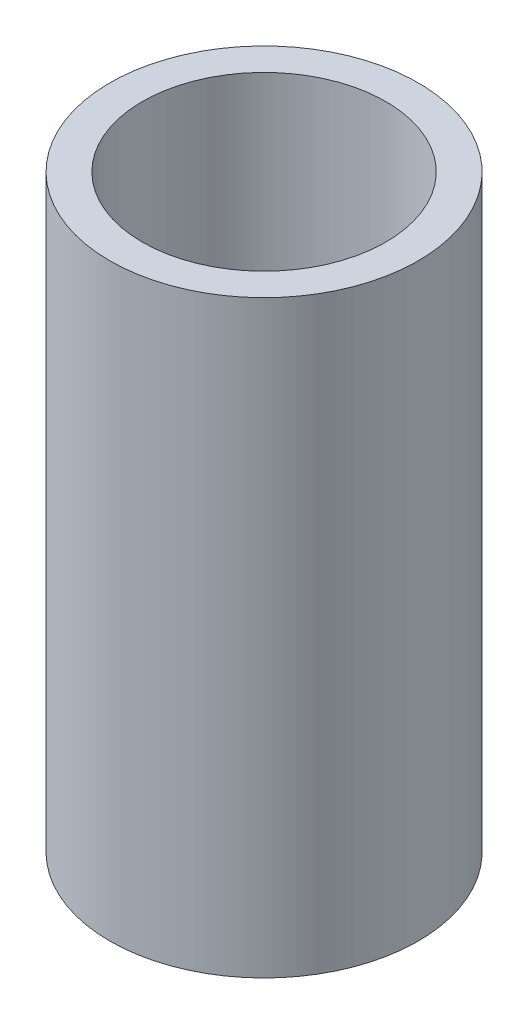
ISO-10303-21;
HEADER;
FILE_DESCRIPTION(('STEP AP214'),'2;1');
FILE_NAME('part.step','',(''),(''),'','','');
FILE_SCHEMA(('AUTOMOTIVE_DESIGN { 1 0 10303 214 1 1 1 1 }'));
ENDSEC;
DATA;
#1=APPLICATION_CONTEXT('core data for automotive mechanical design processes');
#2=APPLICATION_PROTOCOL_DEFINITION('international standard','automotive_design',2000,#1);
#3=PRODUCT_CONTEXT('',#1,'mechanical');
#4=PRODUCT('Part','Part','',(#3));
#5=PRODUCT_RELATED_PRODUCT_CATEGORY('part','',(#4));
#6=PRODUCT_DEFINITION_FORMATION('','',#4);
#7=PRODUCT_DEFINITION_CONTEXT('part definition',#1,'design');
#8=PRODUCT_DEFINITION('design','',#6,#7);
#9=PRODUCT_DEFINITION_SHAPE('','',#8);
#10=(LENGTH_UNIT() NAMED_UNIT(*) SI_UNIT(.MILLI.,.METRE.));
#11=(NAMED_UNIT(*) PLANE_ANGLE_UNIT() SI_UNIT($,.RADIAN.));
#12=(NAMED_UNIT(*) SI_UNIT($,.STERADIAN.) SOLID_ANGLE_UNIT());
#13=UNCERTAINTY_MEASURE_WITH_UNIT(LENGTH_MEASURE(1.E-05),#10,'distance_accuracy_value','');
#14=(GEOMETRIC_REPRESENTATION_CONTEXT(3) GLOBAL_UNCERTAINTY_ASSIGNED_CONTEXT((#13)) GLOBAL_UNIT_ASSIGNED_CONTEXT((#10,
#11,#12)) REPRESENTATION_CONTEXT('',''));
#15=CARTESIAN_POINT('',(0.,0.,0.));
#16=DIRECTION('',(0.,0.,1.));
#17=DIRECTION('',(1.,0.,0.));
#18=AXIS2_PLACEMENT_3D('',#15,#16,#17);
#19=CARTESIAN_POINT('',(0.,15.,0.));
#20=DIRECTION('',(0.,1.,0.));
#21=DIRECTION('',(0.,0.,1.));
#22=AXIS2_PLACEMENT_3D('',#19,#20,#21);
#23=PLANE('',#22);
#24=CARTESIAN_POINT('',(0.,15.,0.));
#25=DIRECTION('',(0.,1.,0.));
#26=DIRECTION('',(0.,0.,1.));
#27=AXIS2_PLACEMENT_3D('',#24,#25,#26);
#28=CIRCLE('',#27,3.925);
#29=CARTESIAN_POINT('',(0.,15.,3.925));
#30=VERTEX_POINT('',#29);
#31=EDGE_CURVE('E10',#30,#30,#28,.T.);
#32=ORIENTED_EDGE('',*,*,#31,.T.);
#33=EDGE_LOOP('',(#32));
#34=FACE_BOUND('',#33,.T.);
#35=CARTESIAN_POINT('',(0.,15.,0.));
#36=DIRECTION('',(0.,1.,0.));
#37=DIRECTION('',(0.,0.,1.));
#38=AXIS2_PLACEMENT_3D('',#35,#36,#37);
#39=CIRCLE('',#38,3.1);
#40=CARTESIAN_POINT('',(0.,15.,3.1));
#41=VERTEX_POINT('',#40);
#42=EDGE_CURVE('E42',#41,#41,#39,.T.);
#43=ORIENTED_EDGE('',*,*,#42,.F.);
#44=EDGE_LOOP('',(#43));
#45=FACE_BOUND('',#44,.T.);
#46=ADVANCED_FACE('F31',(#34,#45),#23,.T.);
#47=CARTESIAN_POINT('',(0.,0.,0.));
#48=DIRECTION('',(0.,1.,0.));
#49=DIRECTION('',(0.,0.,1.));
#50=AXIS2_PLACEMENT_3D('',#47,#48,#49);
#51=PLANE('',#50);
#52=CARTESIAN_POINT('',(0.,0.,0.));
#53=DIRECTION('',(0.,1.,0.));
#54=DIRECTION('',(0.,0.,1.));
#55=AXIS2_PLACEMENT_3D('',#52,#53,#54);
#56=CIRCLE('',#55,3.925);
#57=CARTESIAN_POINT('',(0.,0.,3.925));
#58=VERTEX_POINT('',#57);
#59=EDGE_CURVE('E35',#58,#58,#56,.T.);
#60=ORIENTED_EDGE('',*,*,#59,.F.);
#61=EDGE_LOOP('',(#60));
#62=FACE_BOUND('',#61,.T.);
#63=CARTESIAN_POINT('',(0.,0.,0.));
#64=DIRECTION('',(0.,1.,0.));
#65=DIRECTION('',(0.,0.,1.));
#66=AXIS2_PLACEMENT_3D('',#63,#64,#65);
#67=CIRCLE('',#66,3.1);
#68=CARTESIAN_POINT('',(0.,0.,3.1));
#69=VERTEX_POINT('',#68);
#70=EDGE_CURVE('E44',#69,#69,#67,.T.);
#71=ORIENTED_EDGE('',*,*,#70,.T.);
#72=EDGE_LOOP('',(#71));
#73=FACE_BOUND('',#72,.T.);
#74=ADVANCED_FACE('F54',(#62,#73),#51,.F.);
#75=CARTESIAN_POINT('',(0.,15.,0.));
#76=DIRECTION('',(0.,-1.,0.));
#77=DIRECTION('',(0.,0.,-1.));
#78=AXIS2_PLACEMENT_3D('',#75,#76,#77);
#79=CYLINDRICAL_SURFACE('',#78,3.925);
#80=ORIENTED_EDGE('',*,*,#31,.F.);
#81=EDGE_LOOP('',(#80));
#82=FACE_BOUND('',#81,.T.);
#83=ORIENTED_EDGE('',*,*,#59,.T.);
#84=EDGE_LOOP('',(#83));
#85=FACE_BOUND('',#84,.T.);
#86=ADVANCED_FACE('F33',(#82,#85),#79,.T.);
#87=CARTESIAN_POINT('',(0.,15.,0.));
#88=DIRECTION('',(0.,-1.,0.));
#89=DIRECTION('',(0.,0.,-1.));
#90=AXIS2_PLACEMENT_3D('',#87,#88,#89);
#91=CYLINDRICAL_SURFACE('',#90,3.1);
#92=ORIENTED_EDGE('',*,*,#42,.T.);
#93=EDGE_LOOP('',(#92));
#94=FACE_BOUND('',#93,.T.);
#95=ORIENTED_EDGE('',*,*,#70,.F.);
#96=EDGE_LOOP('',(#95));
#97=FACE_BOUND('',#96,.T.);
#98=ADVANCED_FACE('F50',(#94,#97),#91,.F.);
#99=CLOSED_SHELL('',(#46,#74,#86,#98));
#100=MANIFOLD_SOLID_BREP('B2',#99);
#101=ADVANCED_BREP_SHAPE_REPRESENTATION('',(#18,#100),#14);
#102=SHAPE_DEFINITION_REPRESENTATION(#9,#101);
ENDSEC;
END-ISO-10303-21;
